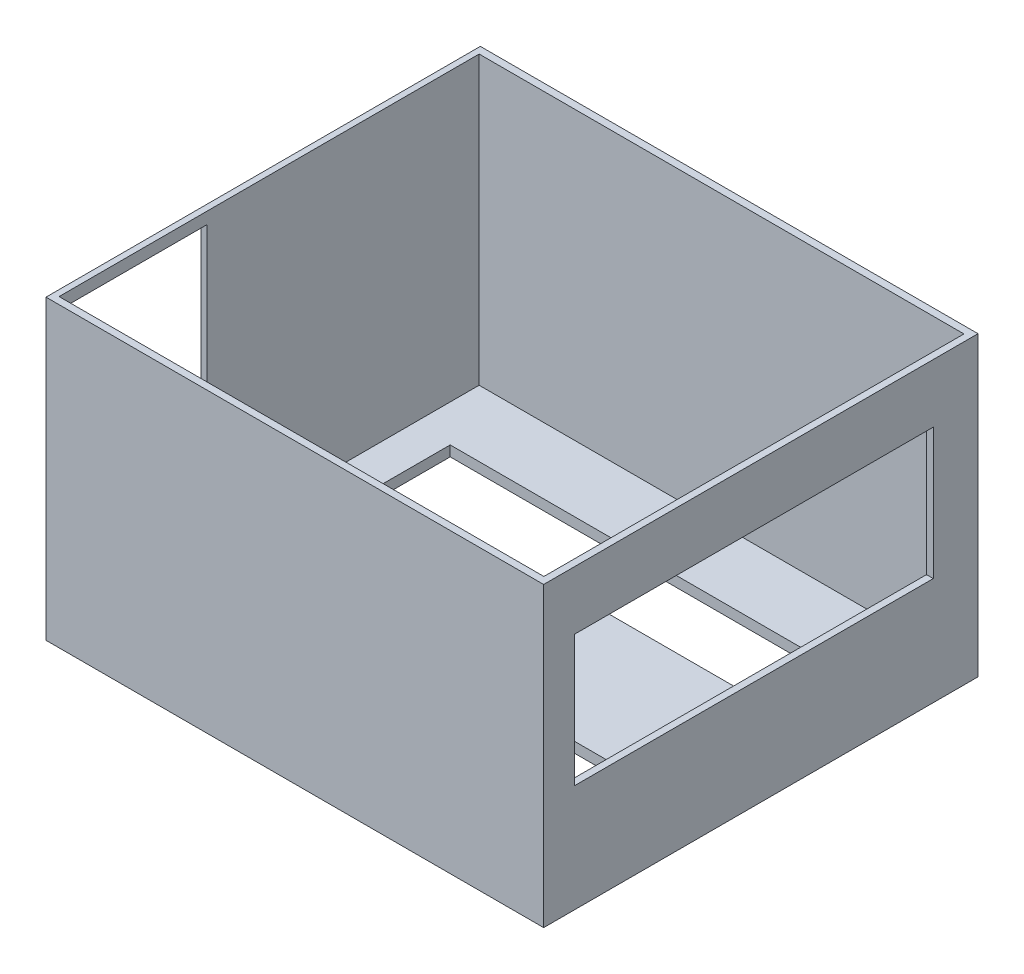
ISO-10303-21;
HEADER;
FILE_DESCRIPTION(('STEP AP214'),'2;1');
FILE_NAME('part.step','',(''),(''),'','','');
FILE_SCHEMA(('AUTOMOTIVE_DESIGN { 1 0 10303 214 1 1 1 1 }'));
ENDSEC;
DATA;
#1=APPLICATION_CONTEXT('core data for automotive mechanical design processes');
#2=APPLICATION_PROTOCOL_DEFINITION('international standard','automotive_design',2000,#1);
#3=PRODUCT_CONTEXT('',#1,'mechanical');
#4=PRODUCT('Part','Part','',(#3));
#5=PRODUCT_RELATED_PRODUCT_CATEGORY('part','',(#4));
#6=PRODUCT_DEFINITION_FORMATION('','',#4);
#7=PRODUCT_DEFINITION_CONTEXT('part definition',#1,'design');
#8=PRODUCT_DEFINITION('design','',#6,#7);
#9=PRODUCT_DEFINITION_SHAPE('','',#8);
#10=(LENGTH_UNIT() NAMED_UNIT(*) SI_UNIT(.MILLI.,.METRE.));
#11=(NAMED_UNIT(*) PLANE_ANGLE_UNIT() SI_UNIT($,.RADIAN.));
#12=(NAMED_UNIT(*) SI_UNIT($,.STERADIAN.) SOLID_ANGLE_UNIT());
#13=UNCERTAINTY_MEASURE_WITH_UNIT(LENGTH_MEASURE(1.E-05),#10,'distance_accuracy_value','');
#14=(GEOMETRIC_REPRESENTATION_CONTEXT(3) GLOBAL_UNCERTAINTY_ASSIGNED_CONTEXT((#13)) GLOBAL_UNIT_ASSIGNED_CONTEXT((#10,
#11,#12)) REPRESENTATION_CONTEXT('',''));
#15=CARTESIAN_POINT('',(0.,0.,0.));
#16=DIRECTION('',(0.,0.,1.));
#17=DIRECTION('',(1.,0.,0.));
#18=AXIS2_PLACEMENT_3D('',#15,#16,#17);
#19=CARTESIAN_POINT('',(-72.9004263333398,3.,-81.3486596621583));
#20=DIRECTION('',(1.,0.,0.));
#21=DIRECTION('',(0.,0.,-1.));
#22=AXIS2_PLACEMENT_3D('',#19,#20,#21);
#23=PLANE('',#22);
#24=DIRECTION('',(0.,0.,1.));
#25=VECTOR('',#24,1.);
#26=CARTESIAN_POINT('',(-72.9004263333398,6.96743208109751,-0.541869807051398));
#27=LINE('',#26,#25);
#28=CARTESIAN_POINT('',(-72.9004263333398,6.96743208109751,-0.541869807051398));
#29=VERTEX_POINT('',#28);
#30=CARTESIAN_POINT('',(-72.9004263333398,6.96743208109751,39.2482942152697));
#31=VERTEX_POINT('',#30);
#32=EDGE_CURVE('E204',#29,#31,#27,.T.);
#33=ORIENTED_EDGE('',*,*,#32,.F.);
#34=DIRECTION('',(0.,-1.,0.));
#35=VECTOR('',#34,1.);
#36=CARTESIAN_POINT('',(-72.9004263333398,6.96743208109751,-0.541869807051398));
#37=LINE('',#36,#35);
#38=CARTESIAN_POINT('',(-72.9004263333398,82.619023043236,-0.541869807051398));
#39=VERTEX_POINT('',#38);
#40=EDGE_CURVE('E47',#39,#29,#37,.T.);
#41=ORIENTED_EDGE('',*,*,#40,.F.);
#42=DIRECTION('',(0.,0.,-1.));
#43=VECTOR('',#42,1.);
#44=CARTESIAN_POINT('',(-72.9004263333398,82.619023043236,-0.541869807051398));
#45=LINE('',#44,#43);
#46=CARTESIAN_POINT('',(-72.9004263333398,82.619023043236,39.2482942152697));
#47=VERTEX_POINT('',#46);
#48=EDGE_CURVE('E210',#47,#39,#45,.T.);
#49=ORIENTED_EDGE('',*,*,#48,.F.);
#50=DIRECTION('',(0.,1.,0.));
#51=VECTOR('',#50,1.);
#52=CARTESIAN_POINT('',(-72.9004263333398,6.96743208109751,39.2482942152697));
#53=LINE('',#52,#51);
#54=EDGE_CURVE('E195',#31,#47,#53,.T.);
#55=ORIENTED_EDGE('',*,*,#54,.F.);
#56=EDGE_LOOP('',(#33,#41,#49,#55));
#57=FACE_BOUND('',#56,.T.);
#58=DIRECTION('',(0.,0.,1.));
#59=VECTOR('',#58,1.);
#60=CARTESIAN_POINT('',(-72.9004263333398,0.,-81.3486596621583));
#61=LINE('',#60,#59);
#62=CARTESIAN_POINT('',(-72.9004263333398,0.,-81.3486596621583));
#63=VERTEX_POINT('',#62);
#64=CARTESIAN_POINT('',(-72.9004263333398,0.,44.3313403378418));
#65=VERTEX_POINT('',#64);
#66=EDGE_CURVE('E320',#63,#65,#61,.T.);
#67=ORIENTED_EDGE('',*,*,#66,.T.);
#68=DIRECTION('',(0.,-1.,0.));
#69=VECTOR('',#68,1.);
#70=CARTESIAN_POINT('',(-72.9004263333398,3.,44.3313403378418));
#71=LINE('',#70,#69);
#72=CARTESIAN_POINT('',(-72.9004263333398,86.,44.3313403378418));
#73=VERTEX_POINT('',#72);
#74=EDGE_CURVE('E338',#73,#65,#71,.T.);
#75=ORIENTED_EDGE('',*,*,#74,.F.);
#76=DIRECTION('',(0.,0.,1.));
#77=VECTOR('',#76,1.);
#78=CARTESIAN_POINT('',(-72.9004263333398,86.,-81.3486596621583));
#79=LINE('',#78,#77);
#80=CARTESIAN_POINT('',(-72.9004263333398,86.,-81.3486596621583));
#81=VERTEX_POINT('',#80);
#82=EDGE_CURVE('E308',#81,#73,#79,.T.);
#83=ORIENTED_EDGE('',*,*,#82,.F.);
#84=DIRECTION('',(0.,-1.,0.));
#85=VECTOR('',#84,1.);
#86=CARTESIAN_POINT('',(-72.9004263333398,3.,-81.3486596621583));
#87=LINE('',#86,#85);
#88=EDGE_CURVE('E329',#81,#63,#87,.T.);
#89=ORIENTED_EDGE('',*,*,#88,.T.);
#90=EDGE_LOOP('',(#67,#75,#83,#89));
#91=FACE_BOUND('',#90,.T.);
#92=ADVANCED_FACE('F33',(#57,#91),#23,.F.);
#93=CARTESIAN_POINT('',(-72.9004263333398,3.,44.3313403378418));
#94=DIRECTION('',(0.,0.,-1.));
#95=DIRECTION('',(-1.,0.,0.));
#96=AXIS2_PLACEMENT_3D('',#93,#94,#95);
#97=PLANE('',#96);
#98=DIRECTION('',(1.,0.,0.));
#99=VECTOR('',#98,1.);
#100=CARTESIAN_POINT('',(-72.9004263333398,0.,44.3313403378418));
#101=LINE('',#100,#99);
#102=CARTESIAN_POINT('',(71.0995736666602,0.,44.3313403378418));
#103=VERTEX_POINT('',#102);
#104=EDGE_CURVE('E323',#65,#103,#101,.T.);
#105=ORIENTED_EDGE('',*,*,#104,.T.);
#106=DIRECTION('',(0.,-1.,0.));
#107=VECTOR('',#106,1.);
#108=CARTESIAN_POINT('',(71.0995736666602,3.,44.3313403378418));
#109=LINE('',#108,#107);
#110=CARTESIAN_POINT('',(71.0995736666602,86.,44.3313403378418));
#111=VERTEX_POINT('',#110);
#112=EDGE_CURVE('E335',#111,#103,#109,.T.);
#113=ORIENTED_EDGE('',*,*,#112,.F.);
#114=DIRECTION('',(1.,0.,0.));
#115=VECTOR('',#114,1.);
#116=CARTESIAN_POINT('',(-72.9004263333398,86.,44.3313403378418));
#117=LINE('',#116,#115);
#118=EDGE_CURVE('E311',#73,#111,#117,.T.);
#119=ORIENTED_EDGE('',*,*,#118,.F.);
#120=ORIENTED_EDGE('',*,*,#74,.T.);
#121=EDGE_LOOP('',(#105,#113,#119,#120));
#122=FACE_BOUND('',#121,.T.);
#123=ADVANCED_FACE('F393',(#122),#97,.F.);
#124=CARTESIAN_POINT('',(71.0995736666602,3.,-81.3486596621583));
#125=DIRECTION('',(-1.,0.,0.));
#126=DIRECTION('',(0.,0.,1.));
#127=AXIS2_PLACEMENT_3D('',#124,#125,#126);
#128=PLANE('',#127);
#129=DIRECTION('',(0.,0.,1.));
#130=VECTOR('',#129,1.);
#131=CARTESIAN_POINT('',(71.0995736666602,69.0565736186954,-68.4081639563487));
#132=LINE('',#131,#130);
#133=CARTESIAN_POINT('',(71.0995736666602,69.0565736186954,-68.4081639563487));
#134=VERTEX_POINT('',#133);
#135=CARTESIAN_POINT('',(71.0995736666602,69.0565736186954,35.3385734528615));
#136=VERTEX_POINT('',#135);
#137=EDGE_CURVE('E261',#134,#136,#132,.T.);
#138=ORIENTED_EDGE('',*,*,#137,.F.);
#139=DIRECTION('',(0.,1.,0.));
#140=VECTOR('',#139,1.);
#141=CARTESIAN_POINT('',(71.0995736666602,69.0565736186954,-68.4081639563487));
#142=LINE('',#141,#140);
#143=CARTESIAN_POINT('',(71.0995736666602,31.1026362835491,-68.4081639563487));
#144=VERTEX_POINT('',#143);
#145=EDGE_CURVE('E253',#144,#134,#142,.T.);
#146=ORIENTED_EDGE('',*,*,#145,.F.);
#147=DIRECTION('',(0.,0.,-1.));
#148=VECTOR('',#147,1.);
#149=CARTESIAN_POINT('',(71.0995736666602,31.1026362835491,-68.4081639563487));
#150=LINE('',#149,#148);
#151=CARTESIAN_POINT('',(71.0995736666602,31.1026362835491,35.3385734528615));
#152=VERTEX_POINT('',#151);
#153=EDGE_CURVE('E267',#152,#144,#150,.T.);
#154=ORIENTED_EDGE('',*,*,#153,.F.);
#155=DIRECTION('',(0.,-1.,0.));
#156=VECTOR('',#155,1.);
#157=CARTESIAN_POINT('',(71.0995736666602,69.0565736186954,35.3385734528615));
#158=LINE('',#157,#156);
#159=EDGE_CURVE('E264',#136,#152,#158,.T.);
#160=ORIENTED_EDGE('',*,*,#159,.F.);
#161=EDGE_LOOP('',(#138,#146,#154,#160));
#162=FACE_BOUND('',#161,.T.);
#163=DIRECTION('',(0.,0.,-1.));
#164=VECTOR('',#163,1.);
#165=CARTESIAN_POINT('',(71.0995736666602,0.,-81.3486596621583));
#166=LINE('',#165,#164);
#167=CARTESIAN_POINT('',(71.0995736666602,0.,-81.3486596621583));
#168=VERTEX_POINT('',#167);
#169=EDGE_CURVE('E325',#103,#168,#166,.T.);
#170=ORIENTED_EDGE('',*,*,#169,.T.);
#171=DIRECTION('',(0.,-1.,0.));
#172=VECTOR('',#171,1.);
#173=CARTESIAN_POINT('',(71.0995736666602,3.,-81.3486596621583));
#174=LINE('',#173,#172);
#175=CARTESIAN_POINT('',(71.0995736666602,86.,-81.3486596621583));
#176=VERTEX_POINT('',#175);
#177=EDGE_CURVE('E332',#176,#168,#174,.T.);
#178=ORIENTED_EDGE('',*,*,#177,.F.);
#179=DIRECTION('',(0.,0.,-1.));
#180=VECTOR('',#179,1.);
#181=CARTESIAN_POINT('',(71.0995736666602,86.,-81.3486596621583));
#182=LINE('',#181,#180);
#183=EDGE_CURVE('E314',#111,#176,#182,.T.);
#184=ORIENTED_EDGE('',*,*,#183,.F.);
#185=ORIENTED_EDGE('',*,*,#112,.T.);
#186=EDGE_LOOP('',(#170,#178,#184,#185));
#187=FACE_BOUND('',#186,.T.);
#188=ADVANCED_FACE('F397',(#162,#187),#128,.F.);
#189=CARTESIAN_POINT('',(-72.9004263333398,3.,-81.3486596621583));
#190=DIRECTION('',(0.,0.,1.));
#191=DIRECTION('',(1.,0.,0.));
#192=AXIS2_PLACEMENT_3D('',#189,#190,#191);
#193=PLANE('',#192);
#194=DIRECTION('',(-1.,0.,0.));
#195=VECTOR('',#194,1.);
#196=CARTESIAN_POINT('',(-72.9004263333398,0.,-81.3486596621583));
#197=LINE('',#196,#195);
#198=EDGE_CURVE('E327',#168,#63,#197,.T.);
#199=ORIENTED_EDGE('',*,*,#198,.T.);
#200=ORIENTED_EDGE('',*,*,#88,.F.);
#201=DIRECTION('',(-1.,0.,0.));
#202=VECTOR('',#201,1.);
#203=CARTESIAN_POINT('',(-72.9004263333398,86.,-81.3486596621583));
#204=LINE('',#203,#202);
#205=EDGE_CURVE('E317',#176,#81,#204,.T.);
#206=ORIENTED_EDGE('',*,*,#205,.F.);
#207=ORIENTED_EDGE('',*,*,#177,.T.);
#208=EDGE_LOOP('',(#199,#200,#206,#207));
#209=FACE_BOUND('',#208,.T.);
#210=ADVANCED_FACE('F402',(#209),#193,.F.);
#211=CARTESIAN_POINT('',(0.,0.,0.));
#212=DIRECTION('',(0.,1.,0.));
#213=DIRECTION('',(0.,0.,1.));
#214=AXIS2_PLACEMENT_3D('',#211,#212,#213);
#215=PLANE('',#214);
#216=DIRECTION('',(-1.,0.,0.));
#217=VECTOR('',#216,1.);
#218=CARTESIAN_POINT('',(50.3282239059786,0.,20.1927565879032));
#219=LINE('',#218,#217);
#220=CARTESIAN_POINT('',(50.3282239059786,0.,20.1927565879032));
#221=VERTEX_POINT('',#220);
#222=CARTESIAN_POINT('',(-60.3855978393995,0.,20.1927565879032));
#223=VERTEX_POINT('',#222);
#224=EDGE_CURVE('E221',#221,#223,#219,.T.);
#225=ORIENTED_EDGE('',*,*,#224,.F.);
#226=DIRECTION('',(0.,0.,1.));
#227=VECTOR('',#226,1.);
#228=CARTESIAN_POINT('',(50.3282239059786,0.,-3.82866748313404));
#229=LINE('',#228,#227);
#230=CARTESIAN_POINT('',(50.3282239059786,0.,-3.82866748313404));
#231=VERTEX_POINT('',#230);
#232=EDGE_CURVE('E217',#231,#221,#229,.T.);
#233=ORIENTED_EDGE('',*,*,#232,.F.);
#234=DIRECTION('',(1.,0.,0.));
#235=VECTOR('',#234,1.);
#236=CARTESIAN_POINT('',(50.3282239059786,0.,-3.82866748313404));
#237=LINE('',#236,#235);
#238=CARTESIAN_POINT('',(-60.3855978393995,0.,-3.82866748313404));
#239=VERTEX_POINT('',#238);
#240=EDGE_CURVE('E227',#239,#231,#237,.T.);
#241=ORIENTED_EDGE('',*,*,#240,.F.);
#242=DIRECTION('',(0.,0.,-1.));
#243=VECTOR('',#242,1.);
#244=CARTESIAN_POINT('',(-60.3855978393995,0.,-3.82866748313404));
#245=LINE('',#244,#243);
#246=EDGE_CURVE('E224',#223,#239,#245,.T.);
#247=ORIENTED_EDGE('',*,*,#246,.F.);
#248=EDGE_LOOP('',(#225,#233,#241,#247));
#249=FACE_BOUND('',#248,.T.);
#250=DIRECTION('',(-1.,0.,0.));
#251=VECTOR('',#250,1.);
#252=CARTESIAN_POINT('',(50.3282239059786,0.,-40.698413022767));
#253=LINE('',#252,#251);
#254=CARTESIAN_POINT('',(50.3282239059786,0.,-40.698413022767));
#255=VERTEX_POINT('',#254);
#256=CARTESIAN_POINT('',(-60.3855978393995,0.,-40.698413022767));
#257=VERTEX_POINT('',#256);
#258=EDGE_CURVE('E241',#255,#257,#253,.T.);
#259=ORIENTED_EDGE('',*,*,#258,.F.);
#260=DIRECTION('',(0.,0.,1.));
#261=VECTOR('',#260,1.);
#262=CARTESIAN_POINT('',(50.3282239059786,0.,-60.1132482088644));
#263=LINE('',#262,#261);
#264=CARTESIAN_POINT('',(50.3282239059786,0.,-60.1132482088644));
#265=VERTEX_POINT('',#264);
#266=EDGE_CURVE('E233',#265,#255,#263,.T.);
#267=ORIENTED_EDGE('',*,*,#266,.F.);
#268=DIRECTION('',(1.,0.,0.));
#269=VECTOR('',#268,1.);
#270=CARTESIAN_POINT('',(50.3282239059786,0.,-60.1132482088644));
#271=LINE('',#270,#269);
#272=CARTESIAN_POINT('',(-60.3855978393995,0.,-60.1132482088644));
#273=VERTEX_POINT('',#272);
#274=EDGE_CURVE('E247',#273,#265,#271,.T.);
#275=ORIENTED_EDGE('',*,*,#274,.F.);
#276=DIRECTION('',(0.,0.,-1.));
#277=VECTOR('',#276,1.);
#278=CARTESIAN_POINT('',(-60.3855978393995,0.,-60.1132482088644));
#279=LINE('',#278,#277);
#280=EDGE_CURVE('E244',#257,#273,#279,.T.);
#281=ORIENTED_EDGE('',*,*,#280,.F.);
#282=EDGE_LOOP('',(#259,#267,#275,#281));
#283=FACE_BOUND('',#282,.T.);
#284=ORIENTED_EDGE('',*,*,#66,.F.);
#285=ORIENTED_EDGE('',*,*,#198,.F.);
#286=ORIENTED_EDGE('',*,*,#169,.F.);
#287=ORIENTED_EDGE('',*,*,#104,.F.);
#288=EDGE_LOOP('',(#284,#285,#286,#287));
#289=FACE_BOUND('',#288,.T.);
#290=ADVANCED_FACE('F408',(#249,#283,#289),#215,.F.);
#291=CARTESIAN_POINT('',(0.,86.,0.));
#292=DIRECTION('',(0.,1.,0.));
#293=DIRECTION('',(0.,0.,1.));
#294=AXIS2_PLACEMENT_3D('',#291,#292,#293);
#295=PLANE('',#294);
#296=ORIENTED_EDGE('',*,*,#82,.T.);
#297=ORIENTED_EDGE('',*,*,#118,.T.);
#298=ORIENTED_EDGE('',*,*,#183,.T.);
#299=ORIENTED_EDGE('',*,*,#205,.T.);
#300=EDGE_LOOP('',(#296,#297,#298,#299));
#301=FACE_BOUND('',#300,.T.);
#302=DIRECTION('',(1.,0.,0.));
#303=VECTOR('',#302,1.);
#304=CARTESIAN_POINT('',(-71.1533002266833,86.,42.2955221364703));
#305=LINE('',#304,#303);
#306=CARTESIAN_POINT('',(-71.1533002266833,86.,42.2955221364703));
#307=VERTEX_POINT('',#306);
#308=CARTESIAN_POINT('',(69.1292159341401,86.,42.2955221364703));
#309=VERTEX_POINT('',#308);
#310=EDGE_CURVE('E282',#307,#309,#305,.T.);
#311=ORIENTED_EDGE('',*,*,#310,.F.);
#312=DIRECTION('',(0.,0.,1.));
#313=VECTOR('',#312,1.);
#314=CARTESIAN_POINT('',(-71.1533002266833,86.,-79.2526556208202));
#315=LINE('',#314,#313);
#316=CARTESIAN_POINT('',(-71.1533002266833,86.,-79.2526556208202));
#317=VERTEX_POINT('',#316);
#318=EDGE_CURVE('E280',#317,#307,#315,.T.);
#319=ORIENTED_EDGE('',*,*,#318,.F.);
#320=DIRECTION('',(-1.,0.,0.));
#321=VECTOR('',#320,1.);
#322=CARTESIAN_POINT('',(-71.1533002266833,86.,-79.2526556208202));
#323=LINE('',#322,#321);
#324=CARTESIAN_POINT('',(69.1292159341401,86.,-79.2526556208202));
#325=VERTEX_POINT('',#324);
#326=EDGE_CURVE('E288',#325,#317,#323,.T.);
#327=ORIENTED_EDGE('',*,*,#326,.F.);
#328=DIRECTION('',(0.,0.,-1.));
#329=VECTOR('',#328,1.);
#330=CARTESIAN_POINT('',(69.1292159341401,86.,-79.2526556208202));
#331=LINE('',#330,#329);
#332=EDGE_CURVE('E285',#309,#325,#331,.T.);
#333=ORIENTED_EDGE('',*,*,#332,.F.);
#334=EDGE_LOOP('',(#311,#319,#327,#333));
#335=FACE_BOUND('',#334,.T.);
#336=ADVANCED_FACE('F412',(#301,#335),#295,.T.);
#337=CARTESIAN_POINT('',(-71.1533002266833,86.,-79.2526556208202));
#338=DIRECTION('',(1.,0.,0.));
#339=DIRECTION('',(0.,0.,-1.));
#340=AXIS2_PLACEMENT_3D('',#337,#338,#339);
#341=PLANE('',#340);
#342=DIRECTION('',(0.,1.,0.));
#343=VECTOR('',#342,1.);
#344=CARTESIAN_POINT('',(-71.1533002266833,86.,-0.541869807051398));
#345=LINE('',#344,#343);
#346=CARTESIAN_POINT('',(-71.1533002266833,6.96743208109751,-0.541869807051398));
#347=VERTEX_POINT('',#346);
#348=CARTESIAN_POINT('',(-71.1533002266833,82.619023043236,-0.541869807051398));
#349=VERTEX_POINT('',#348);
#350=EDGE_CURVE('E11',#347,#349,#345,.T.);
#351=ORIENTED_EDGE('',*,*,#350,.F.);
#352=DIRECTION('',(0.,0.,-1.));
#353=VECTOR('',#352,1.);
#354=CARTESIAN_POINT('',(-71.1533002266833,6.96743208109751,-79.2526556208202));
#355=LINE('',#354,#353);
#356=CARTESIAN_POINT('',(-71.1533002266833,6.96743208109751,39.2482942152697));
#357=VERTEX_POINT('',#356);
#358=EDGE_CURVE('E368',#357,#347,#355,.T.);
#359=ORIENTED_EDGE('',*,*,#358,.F.);
#360=DIRECTION('',(0.,-1.,0.));
#361=VECTOR('',#360,1.);
#362=CARTESIAN_POINT('',(-71.1533002266833,86.,39.2482942152697));
#363=LINE('',#362,#361);
#364=CARTESIAN_POINT('',(-71.1533002266833,82.619023043236,39.2482942152697));
#365=VERTEX_POINT('',#364);
#366=EDGE_CURVE('E198',#365,#357,#363,.T.);
#367=ORIENTED_EDGE('',*,*,#366,.F.);
#368=DIRECTION('',(0.,0.,1.));
#369=VECTOR('',#368,1.);
#370=CARTESIAN_POINT('',(-71.1533002266833,82.619023043236,-79.2526556208202));
#371=LINE('',#370,#369);
#372=EDGE_CURVE('E40',#349,#365,#371,.T.);
#373=ORIENTED_EDGE('',*,*,#372,.F.);
#374=EDGE_LOOP('',(#351,#359,#367,#373));
#375=FACE_BOUND('',#374,.T.);
#376=DIRECTION('',(0.,0.,1.));
#377=VECTOR('',#376,1.);
#378=CARTESIAN_POINT('',(-71.1533002266833,3.,-79.2526556208202));
#379=LINE('',#378,#377);
#380=CARTESIAN_POINT('',(-71.1533002266833,3.,-79.2526556208202));
#381=VERTEX_POINT('',#380);
#382=CARTESIAN_POINT('',(-71.1533002266833,3.,42.2955221364703));
#383=VERTEX_POINT('',#382);
#384=EDGE_CURVE('E273',#381,#383,#379,.T.);
#385=ORIENTED_EDGE('',*,*,#384,.F.);
#386=DIRECTION('',(0.,-1.,0.));
#387=VECTOR('',#386,1.);
#388=CARTESIAN_POINT('',(-71.1533002266833,86.,-79.2526556208202));
#389=LINE('',#388,#387);
#390=EDGE_CURVE('E290',#317,#381,#389,.T.);
#391=ORIENTED_EDGE('',*,*,#390,.F.);
#392=ORIENTED_EDGE('',*,*,#318,.T.);
#393=DIRECTION('',(0.,-1.,0.));
#394=VECTOR('',#393,1.);
#395=CARTESIAN_POINT('',(-71.1533002266833,86.,42.2955221364703));
#396=LINE('',#395,#394);
#397=EDGE_CURVE('E305',#307,#383,#396,.T.);
#398=ORIENTED_EDGE('',*,*,#397,.T.);
#399=EDGE_LOOP('',(#385,#391,#392,#398));
#400=FACE_BOUND('',#399,.T.);
#401=ADVANCED_FACE('F376',(#375,#400),#341,.T.);
#402=CARTESIAN_POINT('',(-71.1533002266833,86.,42.2955221364703));
#403=DIRECTION('',(0.,0.,-1.));
#404=DIRECTION('',(-1.,0.,0.));
#405=AXIS2_PLACEMENT_3D('',#402,#403,#404);
#406=PLANE('',#405);
#407=DIRECTION('',(1.,0.,0.));
#408=VECTOR('',#407,1.);
#409=CARTESIAN_POINT('',(-71.1533002266833,3.,42.2955221364703));
#410=LINE('',#409,#408);
#411=CARTESIAN_POINT('',(69.1292159341401,3.,42.2955221364703));
#412=VERTEX_POINT('',#411);
#413=EDGE_CURVE('E292',#383,#412,#410,.T.);
#414=ORIENTED_EDGE('',*,*,#413,.F.);
#415=ORIENTED_EDGE('',*,*,#397,.F.);
#416=ORIENTED_EDGE('',*,*,#310,.T.);
#417=DIRECTION('',(0.,-1.,0.));
#418=VECTOR('',#417,1.);
#419=CARTESIAN_POINT('',(69.1292159341401,86.,42.2955221364703));
#420=LINE('',#419,#418);
#421=EDGE_CURVE('E302',#309,#412,#420,.T.);
#422=ORIENTED_EDGE('',*,*,#421,.T.);
#423=EDGE_LOOP('',(#414,#415,#416,#422));
#424=FACE_BOUND('',#423,.T.);
#425=ADVANCED_FACE('F425',(#424),#406,.T.);
#426=CARTESIAN_POINT('',(69.1292159341401,86.,-79.2526556208202));
#427=DIRECTION('',(-1.,0.,0.));
#428=DIRECTION('',(0.,0.,1.));
#429=AXIS2_PLACEMENT_3D('',#426,#427,#428);
#430=PLANE('',#429);
#431=DIRECTION('',(0.,-1.,0.));
#432=VECTOR('',#431,1.);
#433=CARTESIAN_POINT('',(69.1292159341401,86.,-68.4081639563487));
#434=LINE('',#433,#432);
#435=CARTESIAN_POINT('',(69.1292159341401,69.0565736186954,-68.4081639563487));
#436=VERTEX_POINT('',#435);
#437=CARTESIAN_POINT('',(69.1292159341401,31.1026362835491,-68.4081639563487));
#438=VERTEX_POINT('',#437);
#439=EDGE_CURVE('E348',#436,#438,#434,.T.);
#440=ORIENTED_EDGE('',*,*,#439,.F.);
#441=DIRECTION('',(0.,0.,-1.));
#442=VECTOR('',#441,1.);
#443=CARTESIAN_POINT('',(69.1292159341401,69.0565736186954,-79.2526556208202));
#444=LINE('',#443,#442);
#445=CARTESIAN_POINT('',(69.1292159341401,69.0565736186954,35.3385734528615));
#446=VERTEX_POINT('',#445);
#447=EDGE_CURVE('E341',#446,#436,#444,.T.);
#448=ORIENTED_EDGE('',*,*,#447,.F.);
#449=DIRECTION('',(0.,1.,0.));
#450=VECTOR('',#449,1.);
#451=CARTESIAN_POINT('',(69.1292159341401,86.,35.3385734528615));
#452=LINE('',#451,#450);
#453=CARTESIAN_POINT('',(69.1292159341401,31.1026362835491,35.3385734528615));
#454=VERTEX_POINT('',#453);
#455=EDGE_CURVE('E343',#454,#446,#452,.T.);
#456=ORIENTED_EDGE('',*,*,#455,.F.);
#457=DIRECTION('',(0.,0.,1.));
#458=VECTOR('',#457,1.);
#459=CARTESIAN_POINT('',(69.1292159341401,31.1026362835491,-79.2526556208202));
#460=LINE('',#459,#458);
#461=EDGE_CURVE('E346',#438,#454,#460,.T.);
#462=ORIENTED_EDGE('',*,*,#461,.F.);
#463=EDGE_LOOP('',(#440,#448,#456,#462));
#464=FACE_BOUND('',#463,.T.);
#465=DIRECTION('',(0.,0.,-1.));
#466=VECTOR('',#465,1.);
#467=CARTESIAN_POINT('',(69.1292159341401,3.,-79.2526556208202));
#468=LINE('',#467,#466);
#469=CARTESIAN_POINT('',(69.1292159341401,3.,-79.2526556208202));
#470=VERTEX_POINT('',#469);
#471=EDGE_CURVE('E294',#412,#470,#468,.T.);
#472=ORIENTED_EDGE('',*,*,#471,.F.);
#473=ORIENTED_EDGE('',*,*,#421,.F.);
#474=ORIENTED_EDGE('',*,*,#332,.T.);
#475=DIRECTION('',(0.,-1.,0.));
#476=VECTOR('',#475,1.);
#477=CARTESIAN_POINT('',(69.1292159341401,86.,-79.2526556208202));
#478=LINE('',#477,#476);
#479=EDGE_CURVE('E299',#325,#470,#478,.T.);
#480=ORIENTED_EDGE('',*,*,#479,.T.);
#481=EDGE_LOOP('',(#472,#473,#474,#480));
#482=FACE_BOUND('',#481,.T.);
#483=ADVANCED_FACE('F428',(#464,#482),#430,.T.);
#484=CARTESIAN_POINT('',(-71.1533002266833,86.,-79.2526556208202));
#485=DIRECTION('',(0.,0.,1.));
#486=DIRECTION('',(1.,0.,0.));
#487=AXIS2_PLACEMENT_3D('',#484,#485,#486);
#488=PLANE('',#487);
#489=DIRECTION('',(-1.,0.,0.));
#490=VECTOR('',#489,1.);
#491=CARTESIAN_POINT('',(-71.1533002266833,3.,-79.2526556208202));
#492=LINE('',#491,#490);
#493=EDGE_CURVE('E283',#470,#381,#492,.T.);
#494=ORIENTED_EDGE('',*,*,#493,.F.);
#495=ORIENTED_EDGE('',*,*,#479,.F.);
#496=ORIENTED_EDGE('',*,*,#326,.T.);
#497=ORIENTED_EDGE('',*,*,#390,.T.);
#498=EDGE_LOOP('',(#494,#495,#496,#497));
#499=FACE_BOUND('',#498,.T.);
#500=ADVANCED_FACE('F418',(#499),#488,.T.);
#501=CARTESIAN_POINT('',(0.,3.,0.));
#502=DIRECTION('',(0.,1.,0.));
#503=DIRECTION('',(0.,0.,1.));
#504=AXIS2_PLACEMENT_3D('',#501,#502,#503);
#505=PLANE('',#504);
#506=DIRECTION('',(0.,0.,-1.));
#507=VECTOR('',#506,1.);
#508=CARTESIAN_POINT('',(50.3282239059786,3.,0.));
#509=LINE('',#508,#507);
#510=CARTESIAN_POINT('',(50.3282239059786,3.,20.1927565879032));
#511=VERTEX_POINT('',#510);
#512=CARTESIAN_POINT('',(50.3282239059786,3.,-3.82866748313404));
#513=VERTEX_POINT('',#512);
#514=EDGE_CURVE('E366',#511,#513,#509,.T.);
#515=ORIENTED_EDGE('',*,*,#514,.F.);
#516=DIRECTION('',(1.,0.,0.));
#517=VECTOR('',#516,1.);
#518=CARTESIAN_POINT('',(0.,3.,20.1927565879032));
#519=LINE('',#518,#517);
#520=CARTESIAN_POINT('',(-60.3855978393995,3.,20.1927565879032));
#521=VERTEX_POINT('',#520);
#522=EDGE_CURVE('E359',#521,#511,#519,.T.);
#523=ORIENTED_EDGE('',*,*,#522,.F.);
#524=DIRECTION('',(0.,0.,1.));
#525=VECTOR('',#524,1.);
#526=CARTESIAN_POINT('',(-60.3855978393995,3.,0.));
#527=LINE('',#526,#525);
#528=CARTESIAN_POINT('',(-60.3855978393995,3.,-3.82866748313404));
#529=VERTEX_POINT('',#528);
#530=EDGE_CURVE('E361',#529,#521,#527,.T.);
#531=ORIENTED_EDGE('',*,*,#530,.F.);
#532=DIRECTION('',(-1.,0.,0.));
#533=VECTOR('',#532,1.);
#534=CARTESIAN_POINT('',(0.,3.,-3.82866748313404));
#535=LINE('',#534,#533);
#536=EDGE_CURVE('E364',#513,#529,#535,.T.);
#537=ORIENTED_EDGE('',*,*,#536,.F.);
#538=EDGE_LOOP('',(#515,#523,#531,#537));
#539=FACE_BOUND('',#538,.T.);
#540=DIRECTION('',(0.,0.,-1.));
#541=VECTOR('',#540,1.);
#542=CARTESIAN_POINT('',(50.3282239059786,3.,0.));
#543=LINE('',#542,#541);
#544=CARTESIAN_POINT('',(50.3282239059786,3.,-40.698413022767));
#545=VERTEX_POINT('',#544);
#546=CARTESIAN_POINT('',(50.3282239059786,3.,-60.1132482088644));
#547=VERTEX_POINT('',#546);
#548=EDGE_CURVE('E357',#545,#547,#543,.T.);
#549=ORIENTED_EDGE('',*,*,#548,.F.);
#550=DIRECTION('',(1.,0.,0.));
#551=VECTOR('',#550,1.);
#552=CARTESIAN_POINT('',(0.,3.,-40.698413022767));
#553=LINE('',#552,#551);
#554=CARTESIAN_POINT('',(-60.3855978393995,3.,-40.698413022767));
#555=VERTEX_POINT('',#554);
#556=EDGE_CURVE('E350',#555,#545,#553,.T.);
#557=ORIENTED_EDGE('',*,*,#556,.F.);
#558=DIRECTION('',(0.,0.,1.));
#559=VECTOR('',#558,1.);
#560=CARTESIAN_POINT('',(-60.3855978393995,3.,0.));
#561=LINE('',#560,#559);
#562=CARTESIAN_POINT('',(-60.3855978393995,3.,-60.1132482088644));
#563=VERTEX_POINT('',#562);
#564=EDGE_CURVE('E352',#563,#555,#561,.T.);
#565=ORIENTED_EDGE('',*,*,#564,.F.);
#566=DIRECTION('',(-1.,0.,0.));
#567=VECTOR('',#566,1.);
#568=CARTESIAN_POINT('',(0.,3.,-60.1132482088644));
#569=LINE('',#568,#567);
#570=EDGE_CURVE('E355',#547,#563,#569,.T.);
#571=ORIENTED_EDGE('',*,*,#570,.F.);
#572=EDGE_LOOP('',(#549,#557,#565,#571));
#573=FACE_BOUND('',#572,.T.);
#574=ORIENTED_EDGE('',*,*,#384,.T.);
#575=ORIENTED_EDGE('',*,*,#413,.T.);
#576=ORIENTED_EDGE('',*,*,#471,.T.);
#577=ORIENTED_EDGE('',*,*,#493,.T.);
#578=EDGE_LOOP('',(#574,#575,#576,#577));
#579=FACE_BOUND('',#578,.T.);
#580=ADVANCED_FACE('F414',(#539,#573,#579),#505,.T.);
#581=CARTESIAN_POINT('',(51.0995736666602,69.0565736186954,-68.4081639563487));
#582=DIRECTION('',(0.,0.,-1.));
#583=DIRECTION('',(-1.,0.,0.));
#584=AXIS2_PLACEMENT_3D('',#581,#582,#583);
#585=PLANE('',#584);
#586=ORIENTED_EDGE('',*,*,#439,.T.);
#587=DIRECTION('',(1.,0.,0.));
#588=VECTOR('',#587,1.);
#589=CARTESIAN_POINT('',(51.0995736666602,31.1026362835491,-68.4081639563487));
#590=LINE('',#589,#588);
#591=EDGE_CURVE('E271',#438,#144,#590,.T.);
#592=ORIENTED_EDGE('',*,*,#591,.T.);
#593=ORIENTED_EDGE('',*,*,#145,.T.);
#594=DIRECTION('',(1.,0.,0.));
#595=VECTOR('',#594,1.);
#596=CARTESIAN_POINT('',(51.0995736666602,69.0565736186954,-68.4081639563487));
#597=LINE('',#596,#595);
#598=EDGE_CURVE('E270',#436,#134,#597,.T.);
#599=ORIENTED_EDGE('',*,*,#598,.F.);
#600=EDGE_LOOP('',(#586,#592,#593,#599));
#601=FACE_BOUND('',#600,.T.);
#602=ADVANCED_FACE('F417',(#601),#585,.F.);
#603=CARTESIAN_POINT('',(51.0995736666602,31.1026362835491,-68.4081639563487));
#604=DIRECTION('',(0.,-1.,0.));
#605=DIRECTION('',(0.,0.,-1.));
#606=AXIS2_PLACEMENT_3D('',#603,#604,#605);
#607=PLANE('',#606);
#608=ORIENTED_EDGE('',*,*,#461,.T.);
#609=DIRECTION('',(1.,0.,0.));
#610=VECTOR('',#609,1.);
#611=CARTESIAN_POINT('',(51.0995736666602,31.1026362835491,35.3385734528615));
#612=LINE('',#611,#610);
#613=EDGE_CURVE('E274',#454,#152,#612,.T.);
#614=ORIENTED_EDGE('',*,*,#613,.T.);
#615=ORIENTED_EDGE('',*,*,#153,.T.);
#616=ORIENTED_EDGE('',*,*,#591,.F.);
#617=EDGE_LOOP('',(#608,#614,#615,#616));
#618=FACE_BOUND('',#617,.T.);
#619=ADVANCED_FACE('F438',(#618),#607,.F.);
#620=CARTESIAN_POINT('',(51.0995736666602,69.0565736186954,35.3385734528615));
#621=DIRECTION('',(0.,0.,1.));
#622=DIRECTION('',(1.,0.,0.));
#623=AXIS2_PLACEMENT_3D('',#620,#621,#622);
#624=PLANE('',#623);
#625=ORIENTED_EDGE('',*,*,#455,.T.);
#626=DIRECTION('',(1.,0.,0.));
#627=VECTOR('',#626,1.);
#628=CARTESIAN_POINT('',(51.0995736666602,69.0565736186954,35.3385734528615));
#629=LINE('',#628,#627);
#630=EDGE_CURVE('E276',#446,#136,#629,.T.);
#631=ORIENTED_EDGE('',*,*,#630,.T.);
#632=ORIENTED_EDGE('',*,*,#159,.T.);
#633=ORIENTED_EDGE('',*,*,#613,.F.);
#634=EDGE_LOOP('',(#625,#631,#632,#633));
#635=FACE_BOUND('',#634,.T.);
#636=ADVANCED_FACE('F444',(#635),#624,.F.);
#637=CARTESIAN_POINT('',(51.0995736666602,69.0565736186954,-68.4081639563487));
#638=DIRECTION('',(0.,1.,0.));
#639=DIRECTION('',(0.,0.,1.));
#640=AXIS2_PLACEMENT_3D('',#637,#638,#639);
#641=PLANE('',#640);
#642=ORIENTED_EDGE('',*,*,#447,.T.);
#643=ORIENTED_EDGE('',*,*,#598,.T.);
#644=ORIENTED_EDGE('',*,*,#137,.T.);
#645=ORIENTED_EDGE('',*,*,#630,.F.);
#646=EDGE_LOOP('',(#642,#643,#644,#645));
#647=FACE_BOUND('',#646,.T.);
#648=ADVANCED_FACE('F440',(#647),#641,.F.);
#649=CARTESIAN_POINT('',(50.3282239059786,20.,-60.1132482088644));
#650=DIRECTION('',(1.,0.,0.));
#651=DIRECTION('',(0.,0.,-1.));
#652=AXIS2_PLACEMENT_3D('',#649,#650,#651);
#653=PLANE('',#652);
#654=ORIENTED_EDGE('',*,*,#548,.T.);
#655=DIRECTION('',(0.,-1.,0.));
#656=VECTOR('',#655,1.);
#657=CARTESIAN_POINT('',(50.3282239059786,20.,-60.1132482088644));
#658=LINE('',#657,#656);
#659=EDGE_CURVE('E251',#547,#265,#658,.T.);
#660=ORIENTED_EDGE('',*,*,#659,.T.);
#661=ORIENTED_EDGE('',*,*,#266,.T.);
#662=DIRECTION('',(0.,-1.,0.));
#663=VECTOR('',#662,1.);
#664=CARTESIAN_POINT('',(50.3282239059786,20.,-40.698413022767));
#665=LINE('',#664,#663);
#666=EDGE_CURVE('E250',#545,#255,#665,.T.);
#667=ORIENTED_EDGE('',*,*,#666,.F.);
#668=EDGE_LOOP('',(#654,#660,#661,#667));
#669=FACE_BOUND('',#668,.T.);
#670=ADVANCED_FACE('F443',(#669),#653,.F.);
#671=CARTESIAN_POINT('',(50.3282239059786,20.,-60.1132482088644));
#672=DIRECTION('',(0.,0.,-1.));
#673=DIRECTION('',(-1.,0.,0.));
#674=AXIS2_PLACEMENT_3D('',#671,#672,#673);
#675=PLANE('',#674);
#676=ORIENTED_EDGE('',*,*,#570,.T.);
#677=DIRECTION('',(0.,-1.,0.));
#678=VECTOR('',#677,1.);
#679=CARTESIAN_POINT('',(-60.3855978393995,20.,-60.1132482088644));
#680=LINE('',#679,#678);
#681=EDGE_CURVE('E254',#563,#273,#680,.T.);
#682=ORIENTED_EDGE('',*,*,#681,.T.);
#683=ORIENTED_EDGE('',*,*,#274,.T.);
#684=ORIENTED_EDGE('',*,*,#659,.F.);
#685=EDGE_LOOP('',(#676,#682,#683,#684));
#686=FACE_BOUND('',#685,.T.);
#687=ADVANCED_FACE('F454',(#686),#675,.F.);
#688=CARTESIAN_POINT('',(-60.3855978393995,20.,-60.1132482088644));
#689=DIRECTION('',(-1.,0.,0.));
#690=DIRECTION('',(0.,0.,1.));
#691=AXIS2_PLACEMENT_3D('',#688,#689,#690);
#692=PLANE('',#691);
#693=ORIENTED_EDGE('',*,*,#564,.T.);
#694=DIRECTION('',(0.,-1.,0.));
#695=VECTOR('',#694,1.);
#696=CARTESIAN_POINT('',(-60.3855978393995,20.,-40.698413022767));
#697=LINE('',#696,#695);
#698=EDGE_CURVE('E256',#555,#257,#697,.T.);
#699=ORIENTED_EDGE('',*,*,#698,.T.);
#700=ORIENTED_EDGE('',*,*,#280,.T.);
#701=ORIENTED_EDGE('',*,*,#681,.F.);
#702=EDGE_LOOP('',(#693,#699,#700,#701));
#703=FACE_BOUND('',#702,.T.);
#704=ADVANCED_FACE('F460',(#703),#692,.F.);
#705=CARTESIAN_POINT('',(50.3282239059786,20.,-40.698413022767));
#706=DIRECTION('',(0.,0.,1.));
#707=DIRECTION('',(1.,0.,0.));
#708=AXIS2_PLACEMENT_3D('',#705,#706,#707);
#709=PLANE('',#708);
#710=ORIENTED_EDGE('',*,*,#556,.T.);
#711=ORIENTED_EDGE('',*,*,#666,.T.);
#712=ORIENTED_EDGE('',*,*,#258,.T.);
#713=ORIENTED_EDGE('',*,*,#698,.F.);
#714=EDGE_LOOP('',(#710,#711,#712,#713));
#715=FACE_BOUND('',#714,.T.);
#716=ADVANCED_FACE('F456',(#715),#709,.F.);
#717=CARTESIAN_POINT('',(50.3282239059786,20.,-3.82866748313404));
#718=DIRECTION('',(1.,0.,0.));
#719=DIRECTION('',(0.,0.,-1.));
#720=AXIS2_PLACEMENT_3D('',#717,#718,#719);
#721=PLANE('',#720);
#722=ORIENTED_EDGE('',*,*,#514,.T.);
#723=DIRECTION('',(0.,-1.,0.));
#724=VECTOR('',#723,1.);
#725=CARTESIAN_POINT('',(50.3282239059786,20.,-3.82866748313404));
#726=LINE('',#725,#724);
#727=EDGE_CURVE('E231',#513,#231,#726,.T.);
#728=ORIENTED_EDGE('',*,*,#727,.T.);
#729=ORIENTED_EDGE('',*,*,#232,.T.);
#730=DIRECTION('',(0.,-1.,0.));
#731=VECTOR('',#730,1.);
#732=CARTESIAN_POINT('',(50.3282239059786,20.,20.1927565879032));
#733=LINE('',#732,#731);
#734=EDGE_CURVE('E230',#511,#221,#733,.T.);
#735=ORIENTED_EDGE('',*,*,#734,.F.);
#736=EDGE_LOOP('',(#722,#728,#729,#735));
#737=FACE_BOUND('',#736,.T.);
#738=ADVANCED_FACE('F459',(#737),#721,.F.);
#739=CARTESIAN_POINT('',(50.3282239059786,20.,-3.82866748313404));
#740=DIRECTION('',(0.,0.,-1.));
#741=DIRECTION('',(-1.,0.,0.));
#742=AXIS2_PLACEMENT_3D('',#739,#740,#741);
#743=PLANE('',#742);
#744=ORIENTED_EDGE('',*,*,#536,.T.);
#745=DIRECTION('',(0.,-1.,0.));
#746=VECTOR('',#745,1.);
#747=CARTESIAN_POINT('',(-60.3855978393995,20.,-3.82866748313404));
#748=LINE('',#747,#746);
#749=EDGE_CURVE('E234',#529,#239,#748,.T.);
#750=ORIENTED_EDGE('',*,*,#749,.T.);
#751=ORIENTED_EDGE('',*,*,#240,.T.);
#752=ORIENTED_EDGE('',*,*,#727,.F.);
#753=EDGE_LOOP('',(#744,#750,#751,#752));
#754=FACE_BOUND('',#753,.T.);
#755=ADVANCED_FACE('F469',(#754),#743,.F.);
#756=CARTESIAN_POINT('',(-60.3855978393995,20.,-3.82866748313404));
#757=DIRECTION('',(-1.,0.,0.));
#758=DIRECTION('',(0.,0.,1.));
#759=AXIS2_PLACEMENT_3D('',#756,#757,#758);
#760=PLANE('',#759);
#761=ORIENTED_EDGE('',*,*,#530,.T.);
#762=DIRECTION('',(0.,-1.,0.));
#763=VECTOR('',#762,1.);
#764=CARTESIAN_POINT('',(-60.3855978393995,20.,20.1927565879032));
#765=LINE('',#764,#763);
#766=EDGE_CURVE('E236',#521,#223,#765,.T.);
#767=ORIENTED_EDGE('',*,*,#766,.T.);
#768=ORIENTED_EDGE('',*,*,#246,.T.);
#769=ORIENTED_EDGE('',*,*,#749,.F.);
#770=EDGE_LOOP('',(#761,#767,#768,#769));
#771=FACE_BOUND('',#770,.T.);
#772=ADVANCED_FACE('F387',(#771),#760,.F.);
#773=CARTESIAN_POINT('',(50.3282239059786,20.,20.1927565879032));
#774=DIRECTION('',(0.,0.,1.));
#775=DIRECTION('',(1.,0.,0.));
#776=AXIS2_PLACEMENT_3D('',#773,#774,#775);
#777=PLANE('',#776);
#778=ORIENTED_EDGE('',*,*,#522,.T.);
#779=ORIENTED_EDGE('',*,*,#734,.T.);
#780=ORIENTED_EDGE('',*,*,#224,.T.);
#781=ORIENTED_EDGE('',*,*,#766,.F.);
#782=EDGE_LOOP('',(#778,#779,#780,#781));
#783=FACE_BOUND('',#782,.T.);
#784=ADVANCED_FACE('F380',(#783),#777,.F.);
#785=CARTESIAN_POINT('',(-52.9004263333398,6.96743208109751,-0.541869807051398));
#786=DIRECTION('',(0.,0.,-1.));
#787=DIRECTION('',(-1.,0.,0.));
#788=AXIS2_PLACEMENT_3D('',#785,#786,#787);
#789=PLANE('',#788);
#790=ORIENTED_EDGE('',*,*,#350,.T.);
#791=DIRECTION('',(-1.,0.,0.));
#792=VECTOR('',#791,1.);
#793=CARTESIAN_POINT('',(-52.9004263333398,82.619023043236,-0.541869807051398));
#794=LINE('',#793,#792);
#795=EDGE_CURVE('E215',#349,#39,#794,.T.);
#796=ORIENTED_EDGE('',*,*,#795,.T.);
#797=ORIENTED_EDGE('',*,*,#40,.T.);
#798=DIRECTION('',(-1.,0.,0.));
#799=VECTOR('',#798,1.);
#800=CARTESIAN_POINT('',(-52.9004263333398,6.96743208109751,-0.541869807051398));
#801=LINE('',#800,#799);
#802=EDGE_CURVE('E201',#347,#29,#801,.T.);
#803=ORIENTED_EDGE('',*,*,#802,.F.);
#804=EDGE_LOOP('',(#790,#796,#797,#803));
#805=FACE_BOUND('',#804,.T.);
#806=ADVANCED_FACE('F378',(#805),#789,.F.);
#807=CARTESIAN_POINT('',(-52.9004263333398,82.619023043236,-0.541869807051398));
#808=DIRECTION('',(0.,1.,0.));
#809=DIRECTION('',(0.,0.,1.));
#810=AXIS2_PLACEMENT_3D('',#807,#808,#809);
#811=PLANE('',#810);
#812=ORIENTED_EDGE('',*,*,#372,.T.);
#813=DIRECTION('',(-1.,0.,0.));
#814=VECTOR('',#813,1.);
#815=CARTESIAN_POINT('',(-52.9004263333398,82.619023043236,39.2482942152697));
#816=LINE('',#815,#814);
#817=EDGE_CURVE('E200',#365,#47,#816,.T.);
#818=ORIENTED_EDGE('',*,*,#817,.T.);
#819=ORIENTED_EDGE('',*,*,#48,.T.);
#820=ORIENTED_EDGE('',*,*,#795,.F.);
#821=EDGE_LOOP('',(#812,#818,#819,#820));
#822=FACE_BOUND('',#821,.T.);
#823=ADVANCED_FACE('F373',(#822),#811,.F.);
#824=CARTESIAN_POINT('',(-52.9004263333398,6.96743208109751,39.2482942152697));
#825=DIRECTION('',(0.,0.,1.));
#826=DIRECTION('',(1.,0.,0.));
#827=AXIS2_PLACEMENT_3D('',#824,#825,#826);
#828=PLANE('',#827);
#829=ORIENTED_EDGE('',*,*,#366,.T.);
#830=DIRECTION('',(-1.,0.,0.));
#831=VECTOR('',#830,1.);
#832=CARTESIAN_POINT('',(-52.9004263333398,6.96743208109751,39.2482942152697));
#833=LINE('',#832,#831);
#834=EDGE_CURVE('E55',#357,#31,#833,.T.);
#835=ORIENTED_EDGE('',*,*,#834,.T.);
#836=ORIENTED_EDGE('',*,*,#54,.T.);
#837=ORIENTED_EDGE('',*,*,#817,.F.);
#838=EDGE_LOOP('',(#829,#835,#836,#837));
#839=FACE_BOUND('',#838,.T.);
#840=ADVANCED_FACE('F192',(#839),#828,.F.);
#841=CARTESIAN_POINT('',(-52.9004263333398,6.96743208109751,-0.541869807051398));
#842=DIRECTION('',(0.,-1.,0.));
#843=DIRECTION('',(0.,0.,-1.));
#844=AXIS2_PLACEMENT_3D('',#841,#842,#843);
#845=PLANE('',#844);
#846=ORIENTED_EDGE('',*,*,#358,.T.);
#847=ORIENTED_EDGE('',*,*,#802,.T.);
#848=ORIENTED_EDGE('',*,*,#32,.T.);
#849=ORIENTED_EDGE('',*,*,#834,.F.);
#850=EDGE_LOOP('',(#846,#847,#848,#849));
#851=FACE_BOUND('',#850,.T.);
#852=ADVANCED_FACE('F205',(#851),#845,.F.);
#853=CLOSED_SHELL('',(#92,#123,#188,#210,#290,#336,#401,#425,#483,#500,#580,#602,#619,#636,#648,
#670,#687,#704,#716,#738,#755,#772,#784,#806,#823,#840,#852));
#854=MANIFOLD_SOLID_BREP('B2',#853);
#855=ADVANCED_BREP_SHAPE_REPRESENTATION('',(#18,#854),#14);
#856=SHAPE_DEFINITION_REPRESENTATION(#9,#855);
ENDSEC;
END-ISO-10303-21;
